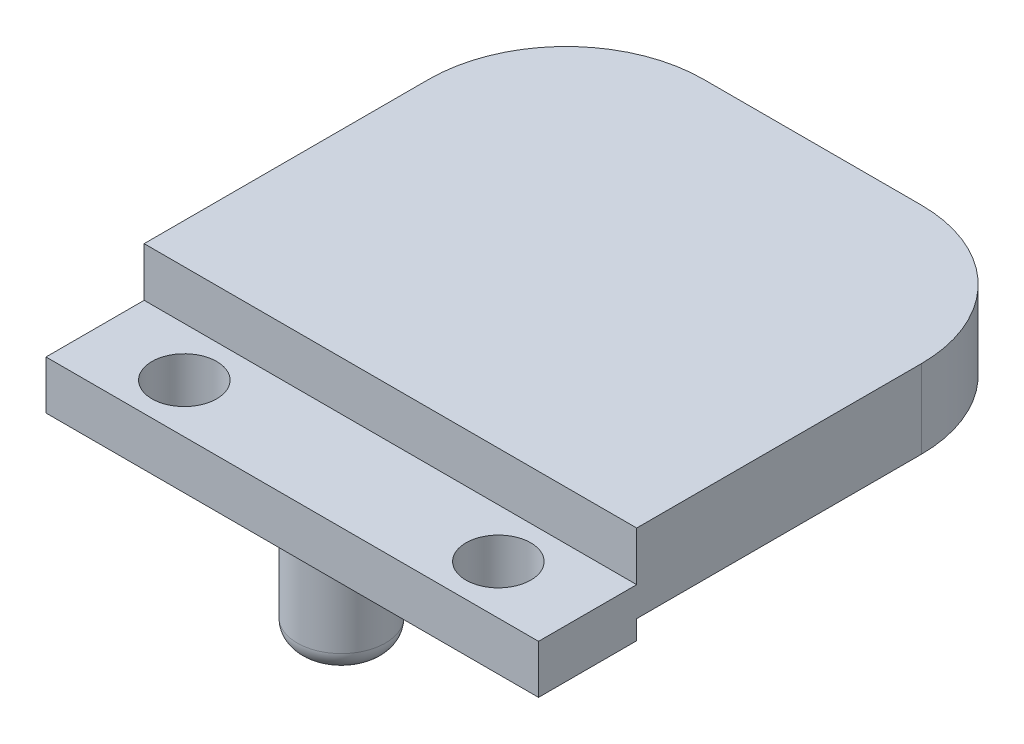
ISO-10303-21;
HEADER;
FILE_DESCRIPTION(('STEP AP214'),'2;1');
FILE_NAME('part.step','',(''),(''),'','','');
FILE_SCHEMA(('AUTOMOTIVE_DESIGN { 1 0 10303 214 1 1 1 1 }'));
ENDSEC;
DATA;
#1=APPLICATION_CONTEXT('core data for automotive mechanical design processes');
#2=APPLICATION_PROTOCOL_DEFINITION('international standard','automotive_design',2000,#1);
#3=PRODUCT_CONTEXT('',#1,'mechanical');
#4=PRODUCT('Part','Part','',(#3));
#5=PRODUCT_RELATED_PRODUCT_CATEGORY('part','',(#4));
#6=PRODUCT_DEFINITION_FORMATION('','',#4);
#7=PRODUCT_DEFINITION_CONTEXT('part definition',#1,'design');
#8=PRODUCT_DEFINITION('design','',#6,#7);
#9=PRODUCT_DEFINITION_SHAPE('','',#8);
#10=(LENGTH_UNIT() NAMED_UNIT(*) SI_UNIT(.MILLI.,.METRE.));
#11=(NAMED_UNIT(*) PLANE_ANGLE_UNIT() SI_UNIT($,.RADIAN.));
#12=(NAMED_UNIT(*) SI_UNIT($,.STERADIAN.) SOLID_ANGLE_UNIT());
#13=UNCERTAINTY_MEASURE_WITH_UNIT(LENGTH_MEASURE(1.E-05),#10,'distance_accuracy_value','');
#14=(GEOMETRIC_REPRESENTATION_CONTEXT(3) GLOBAL_UNCERTAINTY_ASSIGNED_CONTEXT((#13)) GLOBAL_UNIT_ASSIGNED_CONTEXT((#10,
#11,#12)) REPRESENTATION_CONTEXT('',''));
#15=CARTESIAN_POINT('',(0.,0.,0.));
#16=DIRECTION('',(0.,0.,1.));
#17=DIRECTION('',(1.,0.,0.));
#18=AXIS2_PLACEMENT_3D('',#15,#16,#17);
#19=CARTESIAN_POINT('',(-12.5467811820916,-53.9370800671778,23.55));
#20=DIRECTION('',(-1.,0.,0.));
#21=DIRECTION('',(0.,0.,1.));
#22=AXIS2_PLACEMENT_3D('',#19,#20,#21);
#23=PLANE('',#22);
#24=DIRECTION('',(0.,0.,-1.));
#25=VECTOR('',#24,1.);
#26=CARTESIAN_POINT('',(-12.5467811820916,19.75,0.));
#27=LINE('',#26,#25);
#28=CARTESIAN_POINT('',(-12.5467811820916,19.75,0.));
#29=VERTEX_POINT('',#28);
#30=CARTESIAN_POINT('',(-12.5467811820916,19.75,-5.00000000000002));
#31=VERTEX_POINT('',#30);
#32=EDGE_CURVE('E59',#29,#31,#27,.T.);
#33=ORIENTED_EDGE('',*,*,#32,.T.);
#34=DIRECTION('',(0.,1.,0.));
#35=VECTOR('',#34,1.);
#36=CARTESIAN_POINT('',(-12.5467811820916,22.25,-5.));
#37=LINE('',#36,#35);
#38=CARTESIAN_POINT('',(-12.5467811820916,22.25,-5.));
#39=VERTEX_POINT('',#38);
#40=EDGE_CURVE('E131',#31,#39,#37,.T.);
#41=ORIENTED_EDGE('',*,*,#40,.T.);
#42=DIRECTION('',(0.,0.,1.));
#43=VECTOR('',#42,1.);
#44=CARTESIAN_POINT('',(-12.5467811820916,22.25,0.));
#45=LINE('',#44,#43);
#46=CARTESIAN_POINT('',(-12.5467811820916,22.25,-19.5));
#47=VERTEX_POINT('',#46);
#48=EDGE_CURVE('E181',#47,#39,#45,.T.);
#49=ORIENTED_EDGE('',*,*,#48,.F.);
#50=DIRECTION('',(0.,1.,0.));
#51=VECTOR('',#50,1.);
#52=CARTESIAN_POINT('',(-12.5467811820916,18.25,-19.5));
#53=LINE('',#52,#51);
#54=CARTESIAN_POINT('',(-12.5467811820916,18.25,-19.5));
#55=VERTEX_POINT('',#54);
#56=EDGE_CURVE('E215',#47,#55,#53,.F.);
#57=ORIENTED_EDGE('',*,*,#56,.T.);
#58=DIRECTION('',(0.,0.,-1.));
#59=VECTOR('',#58,1.);
#60=CARTESIAN_POINT('',(-12.5467811820916,18.25,-26.5));
#61=LINE('',#60,#59);
#62=CARTESIAN_POINT('',(-12.5467811820916,18.25,-5.));
#63=VERTEX_POINT('',#62);
#64=EDGE_CURVE('E188',#63,#55,#61,.T.);
#65=ORIENTED_EDGE('',*,*,#64,.F.);
#66=DIRECTION('',(0.,1.,0.));
#67=VECTOR('',#66,1.);
#68=CARTESIAN_POINT('',(-12.5467811820916,18.25,-5.));
#69=LINE('',#68,#67);
#70=CARTESIAN_POINT('',(-12.5467811820916,17.2749999999999,-5.));
#71=VERTEX_POINT('',#70);
#72=EDGE_CURVE('E179',#71,#63,#69,.T.);
#73=ORIENTED_EDGE('',*,*,#72,.F.);
#74=DIRECTION('',(0.,0.,-1.));
#75=VECTOR('',#74,1.);
#76=CARTESIAN_POINT('',(-12.5467811820916,17.2749999999999,36.0967811820916));
#77=LINE('',#76,#75);
#78=CARTESIAN_POINT('',(-12.5467811820916,17.2749999999999,0.));
#79=VERTEX_POINT('',#78);
#80=EDGE_CURVE('E67',#79,#71,#77,.T.);
#81=ORIENTED_EDGE('',*,*,#80,.F.);
#82=DIRECTION('',(0.,-1.,0.));
#83=VECTOR('',#82,1.);
#84=CARTESIAN_POINT('',(-12.5467811820916,-22.25,0.));
#85=LINE('',#84,#83);
#86=EDGE_CURVE('E145',#29,#79,#85,.T.);
#87=ORIENTED_EDGE('',*,*,#86,.F.);
#88=EDGE_LOOP('',(#33,#41,#49,#57,#65,#73,#81,#87));
#89=FACE_BOUND('',#88,.T.);
#90=ADVANCED_FACE('F45',(#89),#23,.T.);
#91=CARTESIAN_POINT('',(64.3396378324059,-22.25,0.));
#92=DIRECTION('',(0.,0.,-1.));
#93=DIRECTION('',(0.,1.,0.));
#94=AXIS2_PLACEMENT_3D('',#91,#92,#93);
#95=PLANE('',#94);
#96=DIRECTION('',(1.,0.,0.));
#97=VECTOR('',#96,1.);
#98=CARTESIAN_POINT('',(-12.5467811820916,19.75,0.));
#99=LINE('',#98,#97);
#100=CARTESIAN_POINT('',(12.5467811820916,19.75,0.));
#101=VERTEX_POINT('',#100);
#102=EDGE_CURVE('E132',#29,#101,#99,.T.);
#103=ORIENTED_EDGE('',*,*,#102,.F.);
#104=ORIENTED_EDGE('',*,*,#86,.T.);
#105=DIRECTION('',(-1.,0.,0.));
#106=VECTOR('',#105,1.);
#107=CARTESIAN_POINT('',(-12.5467811820916,17.275,0.));
#108=LINE('',#107,#106);
#109=CARTESIAN_POINT('',(12.5467811820916,17.2749999999999,0.));
#110=VERTEX_POINT('',#109);
#111=EDGE_CURVE('E192',#110,#79,#108,.T.);
#112=ORIENTED_EDGE('',*,*,#111,.F.);
#113=DIRECTION('',(0.,-1.,0.));
#114=VECTOR('',#113,1.);
#115=CARTESIAN_POINT('',(12.5467811820916,-22.25,0.));
#116=LINE('',#115,#114);
#117=EDGE_CURVE('E195',#101,#110,#116,.T.);
#118=ORIENTED_EDGE('',*,*,#117,.F.);
#119=EDGE_LOOP('',(#103,#104,#112,#118));
#120=FACE_BOUND('',#119,.T.);
#121=ADVANCED_FACE('F246',(#120),#95,.F.);
#122=CARTESIAN_POINT('',(12.5467811820916,-53.9370800671778,23.55));
#123=DIRECTION('',(1.,0.,0.));
#124=DIRECTION('',(0.,0.,-1.));
#125=AXIS2_PLACEMENT_3D('',#122,#123,#124);
#126=PLANE('',#125);
#127=DIRECTION('',(0.,0.,-1.));
#128=VECTOR('',#127,1.);
#129=CARTESIAN_POINT('',(12.5467811820916,19.75,0.));
#130=LINE('',#129,#128);
#131=CARTESIAN_POINT('',(12.5467811820916,19.75,-5.00000000000002));
#132=VERTEX_POINT('',#131);
#133=EDGE_CURVE('E130',#101,#132,#130,.T.);
#134=ORIENTED_EDGE('',*,*,#133,.F.);
#135=ORIENTED_EDGE('',*,*,#117,.T.);
#136=DIRECTION('',(0.,0.,-1.));
#137=VECTOR('',#136,1.);
#138=CARTESIAN_POINT('',(12.5467811820916,17.2749999999999,36.0967811820916));
#139=LINE('',#138,#137);
#140=CARTESIAN_POINT('',(12.5467811820916,17.2749999999999,-5.));
#141=VERTEX_POINT('',#140);
#142=EDGE_CURVE('E164',#110,#141,#139,.T.);
#143=ORIENTED_EDGE('',*,*,#142,.T.);
#144=DIRECTION('',(0.,1.,0.));
#145=VECTOR('',#144,1.);
#146=CARTESIAN_POINT('',(12.5467811820916,18.25,-5.));
#147=LINE('',#146,#145);
#148=CARTESIAN_POINT('',(12.5467811820916,18.25,-5.));
#149=VERTEX_POINT('',#148);
#150=EDGE_CURVE('E182',#141,#149,#147,.T.);
#151=ORIENTED_EDGE('',*,*,#150,.T.);
#152=DIRECTION('',(0.,0.,-1.));
#153=VECTOR('',#152,1.);
#154=CARTESIAN_POINT('',(12.5467811820916,18.25,-26.5));
#155=LINE('',#154,#153);
#156=CARTESIAN_POINT('',(12.5467811820916,18.25,-19.5));
#157=VERTEX_POINT('',#156);
#158=EDGE_CURVE('E198',#149,#157,#155,.T.);
#159=ORIENTED_EDGE('',*,*,#158,.T.);
#160=DIRECTION('',(0.,1.,0.));
#161=VECTOR('',#160,1.);
#162=CARTESIAN_POINT('',(12.5467811820916,22.25,-19.5));
#163=LINE('',#162,#161);
#164=CARTESIAN_POINT('',(12.5467811820916,22.25,-19.5));
#165=VERTEX_POINT('',#164);
#166=EDGE_CURVE('E206',#157,#165,#163,.T.);
#167=ORIENTED_EDGE('',*,*,#166,.T.);
#168=DIRECTION('',(0.,0.,1.));
#169=VECTOR('',#168,1.);
#170=CARTESIAN_POINT('',(12.5467811820916,22.25,0.));
#171=LINE('',#170,#169);
#172=CARTESIAN_POINT('',(12.5467811820916,22.25,-5.));
#173=VERTEX_POINT('',#172);
#174=EDGE_CURVE('E194',#165,#173,#171,.T.);
#175=ORIENTED_EDGE('',*,*,#174,.T.);
#176=DIRECTION('',(0.,1.,0.));
#177=VECTOR('',#176,1.);
#178=CARTESIAN_POINT('',(12.5467811820916,22.25,-5.));
#179=LINE('',#178,#177);
#180=EDGE_CURVE('E143',#132,#173,#179,.T.);
#181=ORIENTED_EDGE('',*,*,#180,.F.);
#182=EDGE_LOOP('',(#134,#135,#143,#151,#159,#167,#175,#181));
#183=FACE_BOUND('',#182,.T.);
#184=ADVANCED_FACE('F251',(#183),#126,.T.);
#185=CARTESIAN_POINT('',(64.3396378324059,18.25,-5.));
#186=DIRECTION('',(0.,0.,1.));
#187=DIRECTION('',(0.,-1.,0.));
#188=AXIS2_PLACEMENT_3D('',#185,#186,#187);
#189=PLANE('',#188);
#190=ORIENTED_EDGE('',*,*,#150,.F.);
#191=DIRECTION('',(-1.,0.,0.));
#192=VECTOR('',#191,1.);
#193=CARTESIAN_POINT('',(64.3396378324059,17.2749999999999,-5.));
#194=LINE('',#193,#192);
#195=EDGE_CURVE('E167',#141,#71,#194,.T.);
#196=ORIENTED_EDGE('',*,*,#195,.T.);
#197=ORIENTED_EDGE('',*,*,#72,.T.);
#198=DIRECTION('',(-1.,0.,0.));
#199=VECTOR('',#198,1.);
#200=CARTESIAN_POINT('',(64.3396378324059,18.25,-5.));
#201=LINE('',#200,#199);
#202=EDGE_CURVE('E187',#149,#63,#201,.T.);
#203=ORIENTED_EDGE('',*,*,#202,.F.);
#204=EDGE_LOOP('',(#190,#196,#197,#203));
#205=FACE_BOUND('',#204,.T.);
#206=ADVANCED_FACE('F323',(#205),#189,.F.);
#207=CARTESIAN_POINT('',(64.3396378324059,18.25,-26.5));
#208=DIRECTION('',(0.,1.,0.));
#209=DIRECTION('',(0.,0.,1.));
#210=AXIS2_PLACEMENT_3D('',#207,#208,#209);
#211=PLANE('',#210);
#212=DIRECTION('',(-1.,0.,0.));
#213=VECTOR('',#212,1.);
#214=CARTESIAN_POINT('',(64.3396378324059,18.25,-26.5));
#215=LINE('',#214,#213);
#216=CARTESIAN_POINT('',(0.,18.25,-26.5));
#217=VERTEX_POINT('',#216);
#218=CARTESIAN_POINT('',(-5.54678118209162,18.25,-26.5));
#219=VERTEX_POINT('',#218);
#220=EDGE_CURVE('E189',#217,#219,#215,.T.);
#221=ORIENTED_EDGE('',*,*,#220,.F.);
#222=CARTESIAN_POINT('',(0.,18.25,-20.));
#223=DIRECTION('',(0.,1.,0.));
#224=DIRECTION('',(0.,0.,1.));
#225=AXIS2_PLACEMENT_3D('',#222,#223,#224);
#226=CIRCLE('',#225,6.5);
#227=EDGE_CURVE('E180',#217,#217,#226,.T.);
#228=ORIENTED_EDGE('',*,*,#227,.T.);
#229=CARTESIAN_POINT('',(5.54678118209161,18.25,-26.5));
#230=VERTEX_POINT('',#229);
#231=EDGE_CURVE('E203',#230,#217,#215,.T.);
#232=ORIENTED_EDGE('',*,*,#231,.F.);
#233=CARTESIAN_POINT('',(5.54678118209161,18.25,-19.5));
#234=DIRECTION('',(0.,1.,0.));
#235=DIRECTION('',(0.,0.,1.));
#236=AXIS2_PLACEMENT_3D('',#233,#234,#235);
#237=CIRCLE('',#236,7.);
#238=EDGE_CURVE('E221',#230,#157,#237,.F.);
#239=ORIENTED_EDGE('',*,*,#238,.T.);
#240=ORIENTED_EDGE('',*,*,#158,.F.);
#241=ORIENTED_EDGE('',*,*,#202,.T.);
#242=ORIENTED_EDGE('',*,*,#64,.T.);
#243=CARTESIAN_POINT('',(-5.54678118209162,18.25,-19.5));
#244=DIRECTION('',(0.,1.,0.));
#245=DIRECTION('',(0.,0.,1.));
#246=AXIS2_PLACEMENT_3D('',#243,#244,#245);
#247=CIRCLE('',#246,7.);
#248=EDGE_CURVE('E174',#55,#219,#247,.F.);
#249=ORIENTED_EDGE('',*,*,#248,.T.);
#250=EDGE_LOOP('',(#221,#228,#232,#239,#240,#241,#242,#249));
#251=FACE_BOUND('',#250,.T.);
#252=ADVANCED_FACE('F304',(#251),#211,.F.);
#253=CARTESIAN_POINT('',(64.3396378324059,22.25,-26.5));
#254=DIRECTION('',(0.,0.,1.));
#255=DIRECTION('',(0.,-1.,0.));
#256=AXIS2_PLACEMENT_3D('',#253,#254,#255);
#257=PLANE('',#256);
#258=ORIENTED_EDGE('',*,*,#231,.T.);
#259=ORIENTED_EDGE('',*,*,#220,.T.);
#260=DIRECTION('',(0.,1.,0.));
#261=VECTOR('',#260,1.);
#262=CARTESIAN_POINT('',(-5.54678118209162,22.25,-26.5));
#263=LINE('',#262,#261);
#264=CARTESIAN_POINT('',(-5.54678118209162,22.25,-26.5));
#265=VERTEX_POINT('',#264);
#266=EDGE_CURVE('E217',#219,#265,#263,.T.);
#267=ORIENTED_EDGE('',*,*,#266,.T.);
#268=DIRECTION('',(-1.,0.,0.));
#269=VECTOR('',#268,1.);
#270=CARTESIAN_POINT('',(64.3396378324059,22.25,-26.5));
#271=LINE('',#270,#269);
#272=CARTESIAN_POINT('',(5.54678118209161,22.25,-26.5));
#273=VERTEX_POINT('',#272);
#274=EDGE_CURVE('E184',#273,#265,#271,.T.);
#275=ORIENTED_EDGE('',*,*,#274,.F.);
#276=DIRECTION('',(0.,1.,0.));
#277=VECTOR('',#276,1.);
#278=CARTESIAN_POINT('',(5.54678118209161,18.25,-26.5));
#279=LINE('',#278,#277);
#280=EDGE_CURVE('E211',#273,#230,#279,.F.);
#281=ORIENTED_EDGE('',*,*,#280,.T.);
#282=EDGE_LOOP('',(#258,#259,#267,#275,#281));
#283=FACE_BOUND('',#282,.T.);
#284=ADVANCED_FACE('F308',(#283),#257,.F.);
#285=CARTESIAN_POINT('',(64.3396378324059,22.25,0.));
#286=DIRECTION('',(0.,-1.,0.));
#287=DIRECTION('',(0.,0.,-1.));
#288=AXIS2_PLACEMENT_3D('',#285,#286,#287);
#289=PLANE('',#288);
#290=ORIENTED_EDGE('',*,*,#48,.T.);
#291=DIRECTION('',(1.,0.,0.));
#292=VECTOR('',#291,1.);
#293=CARTESIAN_POINT('',(-12.5467811820916,22.25,-5.));
#294=LINE('',#293,#292);
#295=EDGE_CURVE('E129',#39,#173,#294,.T.);
#296=ORIENTED_EDGE('',*,*,#295,.T.);
#297=ORIENTED_EDGE('',*,*,#174,.F.);
#298=CARTESIAN_POINT('',(5.54678118209161,22.25,-19.5));
#299=DIRECTION('',(0.,-1.,0.));
#300=DIRECTION('',(0.,0.,-1.));
#301=AXIS2_PLACEMENT_3D('',#298,#299,#300);
#302=CIRCLE('',#301,7.);
#303=EDGE_CURVE('E219',#165,#273,#302,.F.);
#304=ORIENTED_EDGE('',*,*,#303,.T.);
#305=ORIENTED_EDGE('',*,*,#274,.T.);
#306=CARTESIAN_POINT('',(-5.54678118209162,22.25,-19.5));
#307=DIRECTION('',(0.,-1.,0.));
#308=DIRECTION('',(0.,0.,-1.));
#309=AXIS2_PLACEMENT_3D('',#306,#307,#308);
#310=CIRCLE('',#309,7.);
#311=EDGE_CURVE('E223',#265,#47,#310,.F.);
#312=ORIENTED_EDGE('',*,*,#311,.T.);
#313=EDGE_LOOP('',(#290,#296,#297,#304,#305,#312));
#314=FACE_BOUND('',#313,.T.);
#315=ADVANCED_FACE('F261',(#314),#289,.F.);
#316=CARTESIAN_POINT('',(-5.54678118209162,22.25,-19.5));
#317=DIRECTION('',(0.,-1.,0.));
#318=DIRECTION('',(0.,0.,-1.));
#319=AXIS2_PLACEMENT_3D('',#316,#317,#318);
#320=CYLINDRICAL_SURFACE('',#319,7.);
#321=ORIENTED_EDGE('',*,*,#248,.F.);
#322=ORIENTED_EDGE('',*,*,#56,.F.);
#323=ORIENTED_EDGE('',*,*,#311,.F.);
#324=ORIENTED_EDGE('',*,*,#266,.F.);
#325=EDGE_LOOP('',(#321,#322,#323,#324));
#326=FACE_BOUND('',#325,.T.);
#327=ADVANCED_FACE('F260',(#326),#320,.T.);
#328=CARTESIAN_POINT('',(5.54678118209161,-53.9370800671778,-19.5000000000001));
#329=DIRECTION('',(0.,-1.,0.));
#330=DIRECTION('',(0.,0.,-1.));
#331=AXIS2_PLACEMENT_3D('',#328,#329,#330);
#332=CYLINDRICAL_SURFACE('',#331,7.);
#333=ORIENTED_EDGE('',*,*,#238,.F.);
#334=ORIENTED_EDGE('',*,*,#280,.F.);
#335=ORIENTED_EDGE('',*,*,#303,.F.);
#336=ORIENTED_EDGE('',*,*,#166,.F.);
#337=EDGE_LOOP('',(#333,#334,#335,#336));
#338=FACE_BOUND('',#337,.T.);
#339=ADVANCED_FACE('F265',(#338),#332,.T.);
#340=CARTESIAN_POINT('',(0.,17.25,-20.));
#341=DIRECTION('',(0.,1.,0.));
#342=DIRECTION('',(0.,0.,1.));
#343=AXIS2_PLACEMENT_3D('',#340,#341,#342);
#344=CYLINDRICAL_SURFACE('',#343,6.5);
#345=CARTESIAN_POINT('',(0.,17.25,-20.));
#346=DIRECTION('',(0.,1.,0.));
#347=DIRECTION('',(0.,0.,1.));
#348=AXIS2_PLACEMENT_3D('',#345,#346,#347);
#349=CIRCLE('',#348,6.5);
#350=CARTESIAN_POINT('',(0.,17.25,-13.5));
#351=VERTEX_POINT('',#350);
#352=EDGE_CURVE('E169',#351,#351,#349,.T.);
#353=ORIENTED_EDGE('',*,*,#352,.T.);
#354=EDGE_LOOP('',(#353));
#355=FACE_BOUND('',#354,.T.);
#356=ORIENTED_EDGE('',*,*,#227,.F.);
#357=EDGE_LOOP('',(#356));
#358=FACE_BOUND('',#357,.T.);
#359=ADVANCED_FACE('F266',(#355,#358),#344,.T.);
#360=CARTESIAN_POINT('',(0.,17.25,-20.));
#361=DIRECTION('',(0.,1.,0.));
#362=DIRECTION('',(0.,0.,1.));
#363=AXIS2_PLACEMENT_3D('',#360,#361,#362);
#364=PLANE('',#363);
#365=CARTESIAN_POINT('',(0.,17.25,-20.));
#366=DIRECTION('',(0.,-1.,0.));
#367=DIRECTION('',(0.,0.,-1.));
#368=AXIS2_PLACEMENT_3D('',#365,#366,#367);
#369=CIRCLE('',#368,6.075);
#370=CARTESIAN_POINT('',(0.,17.25,-26.075));
#371=VERTEX_POINT('',#370);
#372=EDGE_CURVE('E166',#371,#371,#369,.T.);
#373=ORIENTED_EDGE('',*,*,#372,.F.);
#374=EDGE_LOOP('',(#373));
#375=FACE_BOUND('',#374,.T.);
#376=ORIENTED_EDGE('',*,*,#352,.F.);
#377=EDGE_LOOP('',(#376));
#378=FACE_BOUND('',#377,.T.);
#379=ADVANCED_FACE('F288',(#375,#378),#364,.F.);
#380=CARTESIAN_POINT('',(0.,12.25,-20.));
#381=DIRECTION('',(0.,1.,0.));
#382=DIRECTION('',(0.,0.,1.));
#383=AXIS2_PLACEMENT_3D('',#380,#381,#382);
#384=CYLINDRICAL_SURFACE('',#383,6.075);
#385=CARTESIAN_POINT('',(0.,13.25,-20.));
#386=DIRECTION('',(0.,-1.,0.));
#387=DIRECTION('',(0.,0.,-1.));
#388=AXIS2_PLACEMENT_3D('',#385,#386,#387);
#389=CIRCLE('',#388,6.075);
#390=CARTESIAN_POINT('',(0.,13.25,-26.075));
#391=VERTEX_POINT('',#390);
#392=EDGE_CURVE('E160',#391,#391,#389,.F.);
#393=ORIENTED_EDGE('',*,*,#392,.T.);
#394=EDGE_LOOP('',(#393));
#395=FACE_BOUND('',#394,.T.);
#396=ORIENTED_EDGE('',*,*,#372,.T.);
#397=EDGE_LOOP('',(#396));
#398=FACE_BOUND('',#397,.T.);
#399=ADVANCED_FACE('F282',(#395,#398),#384,.T.);
#400=CARTESIAN_POINT('',(0.,12.25,-20.));
#401=DIRECTION('',(0.,-1.,0.));
#402=DIRECTION('',(0.,0.,-1.));
#403=AXIS2_PLACEMENT_3D('',#400,#401,#402);
#404=PLANE('',#403);
#405=CARTESIAN_POINT('',(0.,12.25,-20.));
#406=DIRECTION('',(0.,-1.,0.));
#407=DIRECTION('',(0.,0.,-1.));
#408=AXIS2_PLACEMENT_3D('',#405,#406,#407);
#409=CIRCLE('',#408,5.075);
#410=CARTESIAN_POINT('',(0.,12.25,-25.075));
#411=VERTEX_POINT('',#410);
#412=EDGE_CURVE('E171',#411,#411,#409,.T.);
#413=ORIENTED_EDGE('',*,*,#412,.T.);
#414=EDGE_LOOP('',(#413));
#415=FACE_BOUND('',#414,.T.);
#416=ADVANCED_FACE('F271',(#415),#404,.T.);
#417=CARTESIAN_POINT('',(0.,13.25,-20.));
#418=DIRECTION('',(0.,-1.,0.));
#419=DIRECTION('',(0.,0.,-1.));
#420=AXIS2_PLACEMENT_3D('',#417,#418,#419);
#421=TOROIDAL_SURFACE('',#420,5.075,1.);
#422=ORIENTED_EDGE('',*,*,#392,.F.);
#423=EDGE_LOOP('',(#422));
#424=FACE_BOUND('',#423,.T.);
#425=ORIENTED_EDGE('',*,*,#412,.F.);
#426=EDGE_LOOP('',(#425));
#427=FACE_BOUND('',#426,.T.);
#428=ADVANCED_FACE('F268',(#424,#427),#421,.T.);
#429=CARTESIAN_POINT('',(12.5467811820916,17.2749999999999,36.0967811820916));
#430=DIRECTION('',(0.,1.,0.));
#431=DIRECTION('',(0.,0.,1.));
#432=AXIS2_PLACEMENT_3D('',#429,#430,#431);
#433=PLANE('',#432);
#434=CARTESIAN_POINT('',(0.,17.2749999999999,-2.5));
#435=DIRECTION('',(0.,-1.,0.));
#436=DIRECTION('',(0.,0.,-1.));
#437=AXIS2_PLACEMENT_3D('',#434,#435,#436);
#438=CIRCLE('',#437,2.25);
#439=CARTESIAN_POINT('',(0.,17.2749999999999,-4.75));
#440=VERTEX_POINT('',#439);
#441=EDGE_CURVE('E152',#440,#440,#438,.T.);
#442=ORIENTED_EDGE('',*,*,#441,.F.);
#443=EDGE_LOOP('',(#442));
#444=FACE_BOUND('',#443,.T.);
#445=CARTESIAN_POINT('',(-8.,17.2749999999999,-2.5));
#446=DIRECTION('',(0.,-1.,0.));
#447=DIRECTION('',(0.,0.,-1.));
#448=AXIS2_PLACEMENT_3D('',#445,#446,#447);
#449=CIRCLE('',#448,1.65);
#450=CARTESIAN_POINT('',(-8.,17.2749999999999,-4.15));
#451=VERTEX_POINT('',#450);
#452=EDGE_CURVE('E156',#451,#451,#449,.T.);
#453=ORIENTED_EDGE('',*,*,#452,.F.);
#454=EDGE_LOOP('',(#453));
#455=FACE_BOUND('',#454,.T.);
#456=CARTESIAN_POINT('',(8.,17.2749999999999,-2.5));
#457=DIRECTION('',(0.,-1.,0.));
#458=DIRECTION('',(0.,0.,-1.));
#459=AXIS2_PLACEMENT_3D('',#456,#457,#458);
#460=CIRCLE('',#459,1.65);
#461=CARTESIAN_POINT('',(8.,17.2749999999999,-4.15));
#462=VERTEX_POINT('',#461);
#463=EDGE_CURVE('E151',#462,#462,#460,.T.);
#464=ORIENTED_EDGE('',*,*,#463,.F.);
#465=EDGE_LOOP('',(#464));
#466=FACE_BOUND('',#465,.T.);
#467=ORIENTED_EDGE('',*,*,#111,.T.);
#468=ORIENTED_EDGE('',*,*,#80,.T.);
#469=ORIENTED_EDGE('',*,*,#195,.F.);
#470=ORIENTED_EDGE('',*,*,#142,.F.);
#471=EDGE_LOOP('',(#467,#468,#469,#470));
#472=FACE_BOUND('',#471,.T.);
#473=ADVANCED_FACE('F269',(#444,#455,#466,#472),#433,.F.);
#474=CARTESIAN_POINT('',(8.,22.25,-2.5));
#475=DIRECTION('',(0.,-1.,0.));
#476=DIRECTION('',(0.,0.,-1.));
#477=AXIS2_PLACEMENT_3D('',#474,#475,#476);
#478=CYLINDRICAL_SURFACE('',#477,1.65);
#479=CARTESIAN_POINT('',(8.,19.75,-2.5));
#480=DIRECTION('',(0.,-1.,0.));
#481=DIRECTION('',(0.,0.,-1.));
#482=AXIS2_PLACEMENT_3D('',#479,#480,#481);
#483=CIRCLE('',#482,1.65);
#484=CARTESIAN_POINT('',(8.,19.75,-4.15));
#485=VERTEX_POINT('',#484);
#486=EDGE_CURVE('E147',#485,#485,#483,.F.);
#487=ORIENTED_EDGE('',*,*,#486,.T.);
#488=EDGE_LOOP('',(#487));
#489=FACE_BOUND('',#488,.T.);
#490=ORIENTED_EDGE('',*,*,#463,.T.);
#491=EDGE_LOOP('',(#490));
#492=FACE_BOUND('',#491,.T.);
#493=ADVANCED_FACE('F277',(#489,#492),#478,.F.);
#494=CARTESIAN_POINT('',(-8.,22.25,-2.5));
#495=DIRECTION('',(0.,-1.,0.));
#496=DIRECTION('',(0.,0.,-1.));
#497=AXIS2_PLACEMENT_3D('',#494,#495,#496);
#498=CYLINDRICAL_SURFACE('',#497,1.65);
#499=CARTESIAN_POINT('',(-8.,19.75,-2.5));
#500=DIRECTION('',(0.,-1.,0.));
#501=DIRECTION('',(0.,0.,-1.));
#502=AXIS2_PLACEMENT_3D('',#499,#500,#501);
#503=CIRCLE('',#502,1.65);
#504=CARTESIAN_POINT('',(-8.,19.75,-4.15));
#505=VERTEX_POINT('',#504);
#506=EDGE_CURVE('E46',#505,#505,#503,.F.);
#507=ORIENTED_EDGE('',*,*,#506,.T.);
#508=EDGE_LOOP('',(#507));
#509=FACE_BOUND('',#508,.T.);
#510=ORIENTED_EDGE('',*,*,#452,.T.);
#511=EDGE_LOOP('',(#510));
#512=FACE_BOUND('',#511,.T.);
#513=ADVANCED_FACE('F378',(#509,#512),#498,.F.);
#514=CARTESIAN_POINT('',(0.,12.2749999999999,-2.5));
#515=DIRECTION('',(0.,1.,0.));
#516=DIRECTION('',(0.,0.,1.));
#517=AXIS2_PLACEMENT_3D('',#514,#515,#516);
#518=CYLINDRICAL_SURFACE('',#517,2.25);
#519=CARTESIAN_POINT('',(0.,13.2749999999999,-2.5));
#520=DIRECTION('',(0.,-1.,0.));
#521=DIRECTION('',(0.,0.,-1.));
#522=AXIS2_PLACEMENT_3D('',#519,#520,#521);
#523=CIRCLE('',#522,2.25);
#524=CARTESIAN_POINT('',(0.,13.2749999999999,-4.75));
#525=VERTEX_POINT('',#524);
#526=EDGE_CURVE('E11',#525,#525,#523,.F.);
#527=ORIENTED_EDGE('',*,*,#526,.T.);
#528=EDGE_LOOP('',(#527));
#529=FACE_BOUND('',#528,.T.);
#530=ORIENTED_EDGE('',*,*,#441,.T.);
#531=EDGE_LOOP('',(#530));
#532=FACE_BOUND('',#531,.T.);
#533=ADVANCED_FACE('F241',(#529,#532),#518,.T.);
#534=CARTESIAN_POINT('',(0.,12.2749999999999,-2.5));
#535=DIRECTION('',(0.,-1.,0.));
#536=DIRECTION('',(0.,0.,-1.));
#537=AXIS2_PLACEMENT_3D('',#534,#535,#536);
#538=PLANE('',#537);
#539=CARTESIAN_POINT('',(0.,12.2749999999999,-2.5));
#540=DIRECTION('',(0.,-1.,0.));
#541=DIRECTION('',(0.,0.,-1.));
#542=AXIS2_PLACEMENT_3D('',#539,#540,#541);
#543=CIRCLE('',#542,1.25);
#544=CARTESIAN_POINT('',(0.,12.2749999999999,-3.75));
#545=VERTEX_POINT('',#544);
#546=EDGE_CURVE('E51',#545,#545,#543,.T.);
#547=ORIENTED_EDGE('',*,*,#546,.T.);
#548=EDGE_LOOP('',(#547));
#549=FACE_BOUND('',#548,.T.);
#550=ADVANCED_FACE('F234',(#549),#538,.T.);
#551=CARTESIAN_POINT('',(0.,13.2749999999999,-2.5));
#552=DIRECTION('',(0.,-1.,0.));
#553=DIRECTION('',(0.,0.,-1.));
#554=AXIS2_PLACEMENT_3D('',#551,#552,#553);
#555=TOROIDAL_SURFACE('',#554,1.25,1.);
#556=ORIENTED_EDGE('',*,*,#526,.F.);
#557=EDGE_LOOP('',(#556));
#558=FACE_BOUND('',#557,.T.);
#559=ORIENTED_EDGE('',*,*,#546,.F.);
#560=EDGE_LOOP('',(#559));
#561=FACE_BOUND('',#560,.T.);
#562=ADVANCED_FACE('F42',(#558,#561),#555,.T.);
#563=CARTESIAN_POINT('',(-12.5467811820916,19.75,0.));
#564=DIRECTION('',(0.,-1.,0.));
#565=DIRECTION('',(0.,0.,-1.));
#566=AXIS2_PLACEMENT_3D('',#563,#564,#565);
#567=PLANE('',#566);
#568=ORIENTED_EDGE('',*,*,#506,.F.);
#569=EDGE_LOOP('',(#568));
#570=FACE_BOUND('',#569,.T.);
#571=ORIENTED_EDGE('',*,*,#133,.T.);
#572=DIRECTION('',(1.,0.,0.));
#573=VECTOR('',#572,1.);
#574=CARTESIAN_POINT('',(-12.5467811820916,19.75,-5.00000000000002));
#575=LINE('',#574,#573);
#576=EDGE_CURVE('E125',#31,#132,#575,.T.);
#577=ORIENTED_EDGE('',*,*,#576,.F.);
#578=ORIENTED_EDGE('',*,*,#32,.F.);
#579=ORIENTED_EDGE('',*,*,#102,.T.);
#580=EDGE_LOOP('',(#571,#577,#578,#579));
#581=FACE_BOUND('',#580,.T.);
#582=ORIENTED_EDGE('',*,*,#486,.F.);
#583=EDGE_LOOP('',(#582));
#584=FACE_BOUND('',#583,.T.);
#585=ADVANCED_FACE('F122',(#570,#581,#584),#567,.F.);
#586=CARTESIAN_POINT('',(-12.5467811820916,22.25,-5.));
#587=DIRECTION('',(0.,0.,-1.));
#588=DIRECTION('',(0.,1.,0.));
#589=AXIS2_PLACEMENT_3D('',#586,#587,#588);
#590=PLANE('',#589);
#591=ORIENTED_EDGE('',*,*,#180,.T.);
#592=ORIENTED_EDGE('',*,*,#295,.F.);
#593=ORIENTED_EDGE('',*,*,#40,.F.);
#594=ORIENTED_EDGE('',*,*,#576,.T.);
#595=EDGE_LOOP('',(#591,#592,#593,#594));
#596=FACE_BOUND('',#595,.T.);
#597=ADVANCED_FACE('F133',(#596),#590,.F.);
#598=CLOSED_SHELL('',(#90,#121,#184,#206,#252,#284,#315,#327,#339,#359,#379,#399,#416,#428,#473,
#493,#513,#533,#550,#562,#585,#597));
#599=MANIFOLD_SOLID_BREP('B2',#598);
#600=ADVANCED_BREP_SHAPE_REPRESENTATION('',(#18,#599),#14);
#601=SHAPE_DEFINITION_REPRESENTATION(#9,#600);
ENDSEC;
END-ISO-10303-21;
